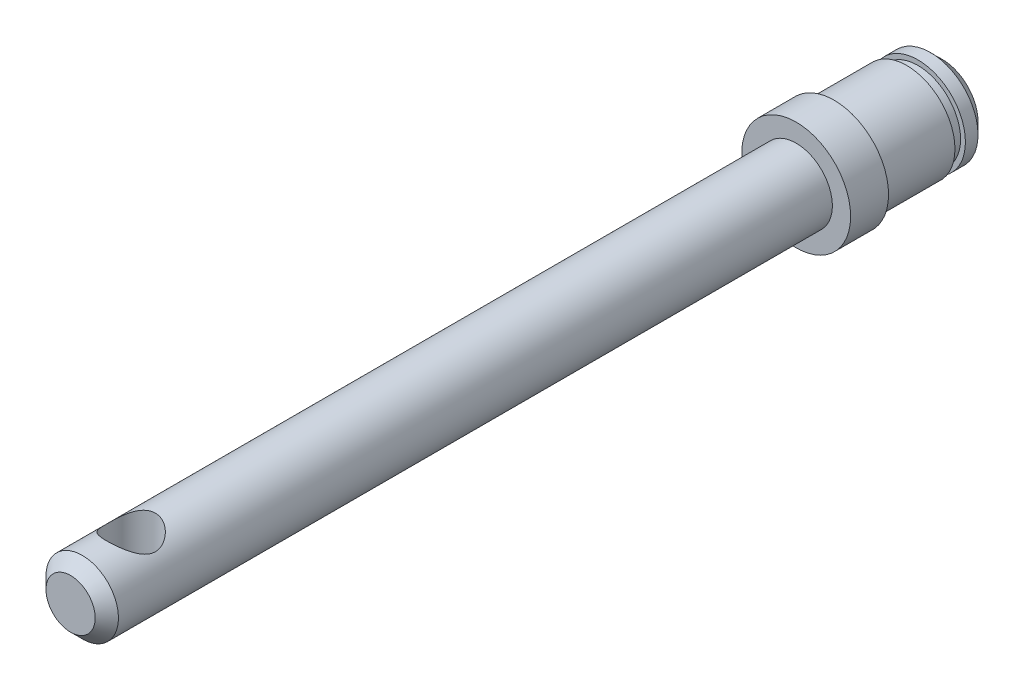
ISO-10303-21;
HEADER;
FILE_DESCRIPTION(('STEP AP214'),'2;1');
FILE_NAME('part.step','',(''),(''),'','','');
FILE_SCHEMA(('AUTOMOTIVE_DESIGN { 1 0 10303 214 1 1 1 1 }'));
ENDSEC;
DATA;
#1=APPLICATION_CONTEXT('core data for automotive mechanical design processes');
#2=APPLICATION_PROTOCOL_DEFINITION('international standard','automotive_design',2000,#1);
#3=PRODUCT_CONTEXT('',#1,'mechanical');
#4=PRODUCT('Part','Part','',(#3));
#5=PRODUCT_RELATED_PRODUCT_CATEGORY('part','',(#4));
#6=PRODUCT_DEFINITION_FORMATION('','',#4);
#7=PRODUCT_DEFINITION_CONTEXT('part definition',#1,'design');
#8=PRODUCT_DEFINITION('design','',#6,#7);
#9=PRODUCT_DEFINITION_SHAPE('','',#8);
#10=(LENGTH_UNIT() NAMED_UNIT(*) SI_UNIT(.MILLI.,.METRE.));
#11=(NAMED_UNIT(*) PLANE_ANGLE_UNIT() SI_UNIT($,.RADIAN.));
#12=(NAMED_UNIT(*) SI_UNIT($,.STERADIAN.) SOLID_ANGLE_UNIT());
#13=UNCERTAINTY_MEASURE_WITH_UNIT(LENGTH_MEASURE(1.E-05),#10,'distance_accuracy_value','');
#14=(GEOMETRIC_REPRESENTATION_CONTEXT(3) GLOBAL_UNCERTAINTY_ASSIGNED_CONTEXT((#13)) GLOBAL_UNIT_ASSIGNED_CONTEXT((#10,
#11,#12)) REPRESENTATION_CONTEXT('',''));
#15=CARTESIAN_POINT('',(0.,0.,0.));
#16=DIRECTION('',(0.,0.,1.));
#17=DIRECTION('',(1.,0.,0.));
#18=AXIS2_PLACEMENT_3D('',#15,#16,#17);
#19=CARTESIAN_POINT('',(0.,0.,-9.5758));
#20=DIRECTION('',(0.,0.,-1.));
#21=DIRECTION('',(-1.,0.,0.));
#22=AXIS2_PLACEMENT_3D('',#19,#20,#21);
#23=PLANE('',#22);
#24=CARTESIAN_POINT('',(0.,0.,-9.57579999993641));
#25=DIRECTION('',(0.,0.,1.));
#26=DIRECTION('',(1.,0.,0.));
#27=AXIS2_PLACEMENT_3D('',#24,#25,#26);
#28=CIRCLE('',#27,2.3494999999798);
#29=CARTESIAN_POINT('',(2.3494999999798,0.,-9.57579999993641));
#30=VERTEX_POINT('',#29);
#31=EDGE_CURVE('E18',#30,#30,#28,.T.);
#32=ORIENTED_EDGE('',*,*,#31,.F.);
#33=EDGE_LOOP('',(#32));
#34=FACE_BOUND('',#33,.T.);
#35=ADVANCED_FACE('F15',(#34),#23,.T.);
#36=CARTESIAN_POINT('',(0.,0.,-8.81380000009813));
#37=DIRECTION('',(0.,0.,1.));
#38=DIRECTION('',(1.,0.,0.));
#39=AXIS2_PLACEMENT_3D('',#36,#37,#38);
#40=CONICAL_SURFACE('',#39,3.11149999987492,0.785398163434747);
#41=ORIENTED_EDGE('',*,*,#31,.T.);
#42=EDGE_LOOP('',(#41));
#43=FACE_BOUND('',#42,.T.);
#44=CARTESIAN_POINT('',(0.,0.,-8.8138));
#45=DIRECTION('',(0.,0.,1.));
#46=DIRECTION('',(1.,0.,0.));
#47=AXIS2_PLACEMENT_3D('',#44,#45,#46);
#48=CIRCLE('',#47,3.1115);
#49=CARTESIAN_POINT('',(3.1115,0.,-8.8138));
#50=VERTEX_POINT('',#49);
#51=EDGE_CURVE('E34',#50,#50,#48,.T.);
#52=ORIENTED_EDGE('',*,*,#51,.F.);
#53=EDGE_LOOP('',(#52));
#54=FACE_BOUND('',#53,.T.);
#55=ADVANCED_FACE('F80',(#43,#54),#40,.T.);
#56=CARTESIAN_POINT('',(0.,0.,-9.5758));
#57=DIRECTION('',(0.,0.,1.));
#58=DIRECTION('',(1.,0.,0.));
#59=AXIS2_PLACEMENT_3D('',#56,#57,#58);
#60=CYLINDRICAL_SURFACE('',#59,3.1115);
#61=ORIENTED_EDGE('',*,*,#51,.T.);
#62=EDGE_LOOP('',(#61));
#63=FACE_BOUND('',#62,.T.);
#64=CARTESIAN_POINT('',(0.,0.,-7.9883));
#65=DIRECTION('',(0.,0.,1.));
#66=DIRECTION('',(1.,0.,0.));
#67=AXIS2_PLACEMENT_3D('',#64,#65,#66);
#68=CIRCLE('',#67,3.1115);
#69=CARTESIAN_POINT('',(3.1115,0.,-7.9883));
#70=VERTEX_POINT('',#69);
#71=EDGE_CURVE('E70',#70,#70,#68,.F.);
#72=ORIENTED_EDGE('',*,*,#71,.T.);
#73=EDGE_LOOP('',(#72));
#74=FACE_BOUND('',#73,.T.);
#75=ADVANCED_FACE('F88',(#63,#74),#60,.T.);
#76=CARTESIAN_POINT('',(0.,0.,-7.9883));
#77=DIRECTION('',(0.,0.,-1.));
#78=DIRECTION('',(-1.,0.,0.));
#79=AXIS2_PLACEMENT_3D('',#76,#77,#78);
#80=PLANE('',#79);
#81=CARTESIAN_POINT('',(0.,0.,-7.9883));
#82=DIRECTION('',(0.,0.,1.));
#83=DIRECTION('',(1.,0.,0.));
#84=AXIS2_PLACEMENT_3D('',#81,#82,#83);
#85=CIRCLE('',#84,2.794);
#86=CARTESIAN_POINT('',(2.794,0.,-7.9883));
#87=VERTEX_POINT('',#86);
#88=EDGE_CURVE('E68',#87,#87,#85,.T.);
#89=ORIENTED_EDGE('',*,*,#88,.F.);
#90=EDGE_LOOP('',(#89));
#91=FACE_BOUND('',#90,.T.);
#92=ORIENTED_EDGE('',*,*,#71,.F.);
#93=EDGE_LOOP('',(#92));
#94=FACE_BOUND('',#93,.T.);
#95=ADVANCED_FACE('F92',(#91,#94),#80,.F.);
#96=CARTESIAN_POINT('',(0.,0.,-7.9883));
#97=DIRECTION('',(0.,0.,1.));
#98=DIRECTION('',(1.,0.,0.));
#99=AXIS2_PLACEMENT_3D('',#96,#97,#98);
#100=CYLINDRICAL_SURFACE('',#99,2.794);
#101=CARTESIAN_POINT('',(0.,0.,-7.2517));
#102=DIRECTION('',(0.,0.,1.));
#103=DIRECTION('',(1.,0.,0.));
#104=AXIS2_PLACEMENT_3D('',#101,#102,#103);
#105=CIRCLE('',#104,2.794);
#106=CARTESIAN_POINT('',(2.794,0.,-7.2517));
#107=VERTEX_POINT('',#106);
#108=EDGE_CURVE('E65',#107,#107,#105,.T.);
#109=ORIENTED_EDGE('',*,*,#108,.F.);
#110=EDGE_LOOP('',(#109));
#111=FACE_BOUND('',#110,.T.);
#112=ORIENTED_EDGE('',*,*,#88,.T.);
#113=EDGE_LOOP('',(#112));
#114=FACE_BOUND('',#113,.T.);
#115=ADVANCED_FACE('F97',(#111,#114),#100,.T.);
#116=CARTESIAN_POINT('',(0.,0.,-7.2517));
#117=DIRECTION('',(0.,0.,-1.));
#118=DIRECTION('',(-1.,0.,0.));
#119=AXIS2_PLACEMENT_3D('',#116,#117,#118);
#120=PLANE('',#119);
#121=ORIENTED_EDGE('',*,*,#108,.T.);
#122=EDGE_LOOP('',(#121));
#123=FACE_BOUND('',#122,.T.);
#124=CARTESIAN_POINT('',(0.,0.,-7.2517));
#125=DIRECTION('',(0.,0.,1.));
#126=DIRECTION('',(1.,0.,0.));
#127=AXIS2_PLACEMENT_3D('',#124,#125,#126);
#128=CIRCLE('',#127,3.1623);
#129=CARTESIAN_POINT('',(3.1623,0.,-7.2517));
#130=VERTEX_POINT('',#129);
#131=EDGE_CURVE('E62',#130,#130,#128,.T.);
#132=ORIENTED_EDGE('',*,*,#131,.F.);
#133=EDGE_LOOP('',(#132));
#134=FACE_BOUND('',#133,.T.);
#135=ADVANCED_FACE('F101',(#123,#134),#120,.T.);
#136=CARTESIAN_POINT('',(0.,0.,-7.2517));
#137=DIRECTION('',(0.,0.,1.));
#138=DIRECTION('',(1.,0.,0.));
#139=AXIS2_PLACEMENT_3D('',#136,#137,#138);
#140=CYLINDRICAL_SURFACE('',#139,3.1623);
#141=ORIENTED_EDGE('',*,*,#131,.T.);
#142=EDGE_LOOP('',(#141));
#143=FACE_BOUND('',#142,.T.);
#144=CARTESIAN_POINT('',(0.,0.,-2.4892));
#145=DIRECTION('',(0.,0.,1.));
#146=DIRECTION('',(1.,0.,0.));
#147=AXIS2_PLACEMENT_3D('',#144,#145,#146);
#148=CIRCLE('',#147,3.1623);
#149=CARTESIAN_POINT('',(3.1623,0.,-2.4892));
#150=VERTEX_POINT('',#149);
#151=EDGE_CURVE('E59',#150,#150,#148,.F.);
#152=ORIENTED_EDGE('',*,*,#151,.T.);
#153=EDGE_LOOP('',(#152));
#154=FACE_BOUND('',#153,.T.);
#155=ADVANCED_FACE('F105',(#143,#154),#140,.T.);
#156=CARTESIAN_POINT('',(0.,0.,-2.4892));
#157=DIRECTION('',(0.,0.,1.));
#158=DIRECTION('',(1.,0.,0.));
#159=AXIS2_PLACEMENT_3D('',#156,#157,#158);
#160=PLANE('',#159);
#161=ORIENTED_EDGE('',*,*,#151,.F.);
#162=EDGE_LOOP('',(#161));
#163=FACE_BOUND('',#162,.T.);
#164=CARTESIAN_POINT('',(0.,0.,-2.4892));
#165=DIRECTION('',(0.,0.,1.));
#166=DIRECTION('',(1.,0.,0.));
#167=AXIS2_PLACEMENT_3D('',#164,#165,#166);
#168=CIRCLE('',#167,3.571875);
#169=CARTESIAN_POINT('',(3.571875,0.,-2.4892));
#170=VERTEX_POINT('',#169);
#171=EDGE_CURVE('E56',#170,#170,#168,.T.);
#172=ORIENTED_EDGE('',*,*,#171,.F.);
#173=EDGE_LOOP('',(#172));
#174=FACE_BOUND('',#173,.T.);
#175=ADVANCED_FACE('F109',(#163,#174),#160,.F.);
#176=CARTESIAN_POINT('',(0.,0.,47.5742));
#177=DIRECTION('',(0.,0.,1.));
#178=DIRECTION('',(1.,0.,0.));
#179=AXIS2_PLACEMENT_3D('',#176,#177,#178);
#180=PLANE('',#179);
#181=CARTESIAN_POINT('',(0.,0.,47.5741999999855));
#182=DIRECTION('',(0.,0.,-1.));
#183=DIRECTION('',(-1.,0.,0.));
#184=AXIS2_PLACEMENT_3D('',#181,#182,#183);
#185=CIRCLE('',#184,1.61289999999781);
#186=CARTESIAN_POINT('',(-1.61289999999781,0.,47.5741999999855));
#187=VERTEX_POINT('',#186);
#188=EDGE_CURVE('E53',#187,#187,#185,.T.);
#189=ORIENTED_EDGE('',*,*,#188,.F.);
#190=EDGE_LOOP('',(#189));
#191=FACE_BOUND('',#190,.T.);
#192=ADVANCED_FACE('F113',(#191),#180,.T.);
#193=CARTESIAN_POINT('',(0.,0.,-2.4892));
#194=DIRECTION('',(0.,0.,1.));
#195=DIRECTION('',(1.,0.,0.));
#196=AXIS2_PLACEMENT_3D('',#193,#194,#195);
#197=CYLINDRICAL_SURFACE('',#196,3.571875);
#198=ORIENTED_EDGE('',*,*,#171,.T.);
#199=EDGE_LOOP('',(#198));
#200=FACE_BOUND('',#199,.T.);
#201=CARTESIAN_POINT('',(0.,0.,0.));
#202=DIRECTION('',(0.,0.,1.));
#203=DIRECTION('',(1.,0.,0.));
#204=AXIS2_PLACEMENT_3D('',#201,#202,#203);
#205=CIRCLE('',#204,3.571875);
#206=CARTESIAN_POINT('',(3.571875,0.,0.));
#207=VERTEX_POINT('',#206);
#208=EDGE_CURVE('E50',#207,#207,#205,.T.);
#209=ORIENTED_EDGE('',*,*,#208,.F.);
#210=EDGE_LOOP('',(#209));
#211=FACE_BOUND('',#210,.T.);
#212=ADVANCED_FACE('F117',(#200,#211),#197,.T.);
#213=CARTESIAN_POINT('',(0.,0.,46.8121999999767));
#214=DIRECTION('',(0.,0.,-1.));
#215=DIRECTION('',(-1.,0.,0.));
#216=AXIS2_PLACEMENT_3D('',#213,#214,#215);
#217=CONICAL_SURFACE('',#216,2.37490000000662,0.785398163397448);
#218=ORIENTED_EDGE('',*,*,#188,.T.);
#219=EDGE_LOOP('',(#218));
#220=FACE_BOUND('',#219,.T.);
#221=CARTESIAN_POINT('',(0.,0.,46.8122));
#222=DIRECTION('',(0.,0.,-1.));
#223=DIRECTION('',(-1.,0.,0.));
#224=AXIS2_PLACEMENT_3D('',#221,#222,#223);
#225=CIRCLE('',#224,2.3749);
#226=CARTESIAN_POINT('',(-2.3749,0.,46.8122));
#227=VERTEX_POINT('',#226);
#228=EDGE_CURVE('E27',#227,#227,#225,.T.);
#229=ORIENTED_EDGE('',*,*,#228,.F.);
#230=EDGE_LOOP('',(#229));
#231=FACE_BOUND('',#230,.T.);
#232=ADVANCED_FACE('F121',(#220,#231),#217,.T.);
#233=CARTESIAN_POINT('',(0.,0.,0.));
#234=DIRECTION('',(0.,0.,1.));
#235=DIRECTION('',(1.,0.,0.));
#236=AXIS2_PLACEMENT_3D('',#233,#234,#235);
#237=PLANE('',#236);
#238=CARTESIAN_POINT('',(0.,0.,0.));
#239=DIRECTION('',(0.,0.,-1.));
#240=DIRECTION('',(-1.,0.,0.));
#241=AXIS2_PLACEMENT_3D('',#238,#239,#240);
#242=CIRCLE('',#241,2.3749);
#243=CARTESIAN_POINT('',(-2.3749,0.,0.));
#244=VERTEX_POINT('',#243);
#245=EDGE_CURVE('E22',#244,#244,#242,.F.);
#246=ORIENTED_EDGE('',*,*,#245,.F.);
#247=EDGE_LOOP('',(#246));
#248=FACE_BOUND('',#247,.T.);
#249=ORIENTED_EDGE('',*,*,#208,.T.);
#250=EDGE_LOOP('',(#249));
#251=FACE_BOUND('',#250,.T.);
#252=ADVANCED_FACE('F124',(#248,#251),#237,.T.);
#253=CARTESIAN_POINT('',(0.,-3.571875,43.60545));
#254=DIRECTION('',(0.,1.,0.));
#255=DIRECTION('',(0.,0.,1.));
#256=AXIS2_PLACEMENT_3D('',#253,#254,#255);
#257=CYLINDRICAL_SURFACE('',#256,1.5875);
#258=CARTESIAN_POINT('',(0.,2.3749,45.19295));
#259=CARTESIAN_POINT('',(-0.0796285021727966,2.37489427166207,45.1929439134093));
#260=CARTESIAN_POINT('',(-0.159333187346092,2.3708547437601,45.1869178453679));
#261=CARTESIAN_POINT('',(-0.316246788253907,2.35507625489168,45.1631617849446));
#262=CARTESIAN_POINT('',(-0.393451638249593,2.34332535323937,45.1454136412255));
#263=CARTESIAN_POINT('',(-0.542790518515763,2.31328830758023,45.0993083312295));
#264=CARTESIAN_POINT('',(-0.614948378456795,2.29503576257873,45.0710056736267));
#265=CARTESIAN_POINT('',(-0.753178545236462,2.25346165524091,45.0050040485006));
#266=CARTESIAN_POINT('',(-0.819251194999285,2.23014037879558,44.9673056109087));
#267=CARTESIAN_POINT('',(-0.949807131451189,2.17792784028168,44.8800881288627));
#268=CARTESIAN_POINT('',(-1.01367601133952,2.14873138397025,44.8298358883516));
#269=CARTESIAN_POINT('',(-1.13266066753279,2.0884656766868,44.7206931180195));
#270=CARTESIAN_POINT('',(-1.18776336726205,2.05739372150985,44.6617899306125));
#271=CARTESIAN_POINT('',(-1.29659427145063,1.99089626995362,44.5261680967343));
#272=CARTESIAN_POINT('',(-1.34871636553572,1.95556248733199,44.4481056626616));
#273=CARTESIAN_POINT('',(-1.43904349853149,1.89008374794265,44.2823403381314));
#274=CARTESIAN_POINT('',(-1.4772725865024,1.85992987284409,44.1946544520516));
#275=CARTESIAN_POINT('',(-1.52904517834333,1.81740283377534,44.0377472795276));
#276=CARTESIAN_POINT('',(-1.54653236351236,1.80240921282223,43.9705447171603));
#277=CARTESIAN_POINT('',(-1.57261168441343,1.77970474695812,43.8332848433952));
#278=CARTESIAN_POINT('',(-1.58121930044462,1.7719812296935,43.763232722255));
#279=CARTESIAN_POINT('',(-1.58899802612375,1.76501215254764,43.6218716388384));
#280=CARTESIAN_POINT('',(-1.58812985724121,1.76580188116326,43.5505586693621));
#281=CARTESIAN_POINT('',(-1.57692650593038,1.77581049841768,43.4092572197684));
#282=CARTESIAN_POINT('',(-1.56658327442516,1.7850365537139,43.3392699174096));
#283=CARTESIAN_POINT('',(-1.53778680769931,1.80988877384798,43.2056567626746));
#284=CARTESIAN_POINT('',(-1.51972103829905,1.82520699487101,43.1418863605764));
#285=CARTESIAN_POINT('',(-1.47635800673587,1.86045582345457,43.0182351850859));
#286=CARTESIAN_POINT('',(-1.45105836975688,1.88038794530891,42.9583556969829));
#287=CARTESIAN_POINT('',(-1.38804369169894,1.92751840139636,42.8311724358925));
#288=CARTESIAN_POINT('',(-1.34884877883874,1.95536954816995,42.7648460457442));
#289=CARTESIAN_POINT('',(-1.26169992826936,2.01270750683002,42.6389401049234));
#290=CARTESIAN_POINT('',(-1.21373539144903,2.04219626760565,42.5793688613398));
#291=CARTESIAN_POINT('',(-1.09822042057742,2.10697571698643,42.4553504562286));
#292=CARTESIAN_POINT('',(-1.02867941502371,2.14213147691545,42.3926663982129));
#293=CARTESIAN_POINT('',(-0.87829590652397,2.20804612806214,42.2797162875604));
#294=CARTESIAN_POINT('',(-0.797461070213304,2.23880797360637,42.2294418743602));
#295=CARTESIAN_POINT('',(-0.642794196366182,2.28740091649053,42.151857840345));
#296=CARTESIAN_POINT('',(-0.570673934887535,2.30658392602361,42.1219812810788));
#297=CARTESIAN_POINT('',(-0.421590346714549,2.33841465201831,42.0729550712348));
#298=CARTESIAN_POINT('',(-0.344638477425361,2.35107721947041,42.05378103609));
#299=CARTESIAN_POINT('',(-0.222529004084351,2.36486476954346,42.0329936390966));
#300=CARTESIAN_POINT('',(-0.178308116016056,2.36861511899109,42.0273651451537));
#301=CARTESIAN_POINT('',(-0.0893995612791168,2.37363462559172,42.0198411908061));
#302=CARTESIAN_POINT('',(-0.0447117904210668,2.37490321648955,42.0179465823498));
#303=CARTESIAN_POINT('',(0.0796285021727959,2.37489427166207,42.0179560865907));
#304=CARTESIAN_POINT('',(0.159333187346092,2.3708547437601,42.0239821546321));
#305=CARTESIAN_POINT('',(0.316246788253906,2.35507625489168,42.0477382150553));
#306=CARTESIAN_POINT('',(0.393451638249593,2.34332535323937,42.0654863587745));
#307=CARTESIAN_POINT('',(0.542790518515763,2.31328830758023,42.1115916687705));
#308=CARTESIAN_POINT('',(0.614948378456795,2.29503576257873,42.1398943263733));
#309=CARTESIAN_POINT('',(0.753178545236463,2.25346165524091,42.2058959514994));
#310=CARTESIAN_POINT('',(0.819251194999285,2.23014037879558,42.2435943890913));
#311=CARTESIAN_POINT('',(0.949807131451189,2.17792784028168,42.3308118711373));
#312=CARTESIAN_POINT('',(1.01367601133952,2.14873138397025,42.3810641116484));
#313=CARTESIAN_POINT('',(1.13266066753279,2.0884656766868,42.4902068819805));
#314=CARTESIAN_POINT('',(1.18776336726205,2.05739372150985,42.5491100693874));
#315=CARTESIAN_POINT('',(1.29659427145063,1.99089626995362,42.6847319032657));
#316=CARTESIAN_POINT('',(1.34871636553572,1.95556248733199,42.7627943373384));
#317=CARTESIAN_POINT('',(1.43904349853149,1.89008374794265,42.9285596618686));
#318=CARTESIAN_POINT('',(1.4772725865024,1.85992987284409,43.0162455479484));
#319=CARTESIAN_POINT('',(1.52904517834333,1.81740283377534,43.1731527204724));
#320=CARTESIAN_POINT('',(1.54653236351236,1.80240921282223,43.2403552828397));
#321=CARTESIAN_POINT('',(1.57261168441343,1.77970474695812,43.3776151566048));
#322=CARTESIAN_POINT('',(1.58121930044462,1.7719812296935,43.447667277745));
#323=CARTESIAN_POINT('',(1.58899802612375,1.76501215254764,43.5890283611616));
#324=CARTESIAN_POINT('',(1.58812985724121,1.76580188116326,43.6603413306379));
#325=CARTESIAN_POINT('',(1.57692650593038,1.77581049841768,43.8016427802316));
#326=CARTESIAN_POINT('',(1.56658327442517,1.7850365537139,43.8716300825904));
#327=CARTESIAN_POINT('',(1.53778680769931,1.80988877384798,44.0052432373254));
#328=CARTESIAN_POINT('',(1.51972103829905,1.825206994871,44.0690136394236));
#329=CARTESIAN_POINT('',(1.47635800673587,1.86045582345457,44.192664814914));
#330=CARTESIAN_POINT('',(1.45105836975689,1.88038794530891,44.2525443030171));
#331=CARTESIAN_POINT('',(1.38804369169894,1.92751840139636,44.3797275641075));
#332=CARTESIAN_POINT('',(1.34884877883874,1.95536954816995,44.4460539542558));
#333=CARTESIAN_POINT('',(1.26169992826936,2.01270750683002,44.5719598950766));
#334=CARTESIAN_POINT('',(1.21373539144903,2.04219626760564,44.6315311386602));
#335=CARTESIAN_POINT('',(1.09822042057742,2.10697571698643,44.7555495437714));
#336=CARTESIAN_POINT('',(1.02867941502371,2.14213147691544,44.8182336017871));
#337=CARTESIAN_POINT('',(0.87829590652398,2.20804612806214,44.9311837124396));
#338=CARTESIAN_POINT('',(0.797461070213316,2.23880797360636,44.9814581256398));
#339=CARTESIAN_POINT('',(0.642794196366197,2.28740091649053,45.059042159655));
#340=CARTESIAN_POINT('',(0.57067393488755,2.30658392602361,45.0889187189212));
#341=CARTESIAN_POINT('',(0.421590346714565,2.33841465201831,45.1379449287651));
#342=CARTESIAN_POINT('',(0.344638477425378,2.3510772194704,45.15711896391));
#343=CARTESIAN_POINT('',(0.222529004084365,2.36486476954346,45.1779063609034));
#344=CARTESIAN_POINT('',(0.178308116016067,2.36861511899109,45.1835348548463));
#345=CARTESIAN_POINT('',(0.0893995612791212,2.37363462559172,45.1910588091939));
#346=CARTESIAN_POINT('',(0.0447117904210687,2.37490321648955,45.1929534176502));
#347=CARTESIAN_POINT('',(0.,2.3749,45.19295));
#348=B_SPLINE_CURVE_WITH_KNOTS('',3,(#258,#259,#260,#261,#262,#263,#264,#265,#266,#267,#268,
#269,#270,#271,#272,#273,#274,#275,#276,#277,#278,#279,#280,#281,#282,#283,#284,#285,#286,#287,
#288,#289,#290,#291,#292,#293,#294,#295,#296,#297,#298,#299,#300,#301,#302,#303,#304,#305,#306,
#307,#308,#309,#310,#311,#312,#313,#314,#315,#316,#317,#318,#319,#320,#321,#322,#323,#324,#325,
#326,#327,#328,#329,#330,#331,#332,#333,#334,#335,#336,#337,#338,#339,#340,#341,#342,#343,#344,
#345,#346,#347),.UNSPECIFIED.,.T.,.F.,(4,2,2,2,2,2,2,2,2,2,2,2,2,2,2,2,2,2,2,2,2,2,2,2,2,2,2,2,
2,2,2,2,2,2,2,2,2,2,2,2,2,2,2,2,4),(0.,0.238700395852421,0.477771282535445,0.71562421428543,
0.95346373392742,1.21155549797826,1.47002872073382,1.76952408912618,2.06849852769238,
2.28077891750231,2.49268859719911,2.70547700634111,2.9184463472867,3.12179507761272,
3.32521064236503,3.57012288877609,3.815333120713,4.1139409115089,4.41234697329097,
4.65252034508975,4.89214425005817,5.02614510978654,5.16017654051243,5.39887693636485,
5.63794782304788,5.87580075479786,6.11364027443985,6.37173203849069,6.63020526124625,
6.92970062963861,7.22867506820481,7.44095545801474,7.65286513771153,7.86565354685354,
8.07862288779913,8.28197161812515,8.48538718287745,8.73029942928851,8.97550966122542,
9.27411745202132,9.57252351380338,9.81269688560216,10.0523207905706,10.186321650299,
10.3203530810249),.UNSPECIFIED.);
#349=CARTESIAN_POINT('',(0.,2.3749,45.19295));
#350=VERTEX_POINT('',#349);
#351=EDGE_CURVE('E45',#350,#350,#348,.T.);
#352=ORIENTED_EDGE('',*,*,#351,.F.);
#353=EDGE_LOOP('',(#352));
#354=FACE_BOUND('',#353,.T.);
#355=CARTESIAN_POINT('',(0.,-2.3749,45.19295));
#356=CARTESIAN_POINT('',(0.079628502172797,-2.37489427166208,45.1929439134093));
#357=CARTESIAN_POINT('',(0.159333187346093,-2.3708547437601,45.1869178453679));
#358=CARTESIAN_POINT('',(0.316246788253907,-2.35507625489168,45.1631617849446));
#359=CARTESIAN_POINT('',(0.393451638249594,-2.34332535323937,45.1454136412255));
#360=CARTESIAN_POINT('',(0.542790518515763,-2.31328830758023,45.0993083312295));
#361=CARTESIAN_POINT('',(0.614948378456796,-2.29503576257873,45.0710056736267));
#362=CARTESIAN_POINT('',(0.753178545236462,-2.25346165524091,45.0050040485006));
#363=CARTESIAN_POINT('',(0.819251194999285,-2.23014037879558,44.9673056109087));
#364=CARTESIAN_POINT('',(0.949807131451189,-2.17792784028168,44.8800881288627));
#365=CARTESIAN_POINT('',(1.01367601133952,-2.14873138397025,44.8298358883516));
#366=CARTESIAN_POINT('',(1.13266066753279,-2.0884656766868,44.7206931180195));
#367=CARTESIAN_POINT('',(1.18776336726205,-2.05739372150985,44.6617899306125));
#368=CARTESIAN_POINT('',(1.29659427145063,-1.99089626995362,44.5261680967343));
#369=CARTESIAN_POINT('',(1.34871636553572,-1.95556248733199,44.4481056626616));
#370=CARTESIAN_POINT('',(1.43904349853149,-1.89008374794265,44.2823403381314));
#371=CARTESIAN_POINT('',(1.4772725865024,-1.85992987284409,44.1946544520516));
#372=CARTESIAN_POINT('',(1.52904517834333,-1.81740283377534,44.0377472795276));
#373=CARTESIAN_POINT('',(1.54653236351237,-1.80240921282223,43.9705447171602));
#374=CARTESIAN_POINT('',(1.57261168441344,-1.77970474695812,43.8332848433952));
#375=CARTESIAN_POINT('',(1.58121930044462,-1.7719812296935,43.763232722255));
#376=CARTESIAN_POINT('',(1.58899802612375,-1.76501215254764,43.6218716388384));
#377=CARTESIAN_POINT('',(1.58812985724121,-1.76580188116326,43.5505586693621));
#378=CARTESIAN_POINT('',(1.57692650593038,-1.77581049841768,43.4092572197684));
#379=CARTESIAN_POINT('',(1.56658327442516,-1.7850365537139,43.3392699174096));
#380=CARTESIAN_POINT('',(1.53778680769931,-1.80988877384798,43.2056567626746));
#381=CARTESIAN_POINT('',(1.51972103829905,-1.82520699487101,43.1418863605764));
#382=CARTESIAN_POINT('',(1.47635800673587,-1.86045582345457,43.0182351850859));
#383=CARTESIAN_POINT('',(1.45105836975688,-1.88038794530891,42.9583556969829));
#384=CARTESIAN_POINT('',(1.38804369169894,-1.92751840139636,42.8311724358925));
#385=CARTESIAN_POINT('',(1.34884877883874,-1.95536954816995,42.7648460457442));
#386=CARTESIAN_POINT('',(1.26169992826936,-2.01270750683002,42.6389401049234));
#387=CARTESIAN_POINT('',(1.21373539144903,-2.04219626760565,42.5793688613398));
#388=CARTESIAN_POINT('',(1.09822042057742,-2.10697571698643,42.4553504562286));
#389=CARTESIAN_POINT('',(1.0286794150237,-2.14213147691545,42.3926663982129));
#390=CARTESIAN_POINT('',(0.878295906523966,-2.20804612806214,42.2797162875604));
#391=CARTESIAN_POINT('',(0.797461070213302,-2.23880797360637,42.2294418743602));
#392=CARTESIAN_POINT('',(0.642794196366183,-2.28740091649053,42.151857840345));
#393=CARTESIAN_POINT('',(0.570673934887537,-2.30658392602361,42.1219812810788));
#394=CARTESIAN_POINT('',(0.421590346714551,-2.33841465201831,42.0729550712348));
#395=CARTESIAN_POINT('',(0.344638477425362,-2.35107721947041,42.05378103609));
#396=CARTESIAN_POINT('',(0.22252900408435,-2.36486476954346,42.0329936390966));
#397=CARTESIAN_POINT('',(0.178308116016056,-2.36861511899109,42.0273651451537));
#398=CARTESIAN_POINT('',(0.0893995612791169,-2.37363462559172,42.0198411908061));
#399=CARTESIAN_POINT('',(0.0447117904210671,-2.37490321648955,42.0179465823498));
#400=CARTESIAN_POINT('',(-0.0796285021727957,-2.37489427166208,42.0179560865907));
#401=CARTESIAN_POINT('',(-0.159333187346092,-2.3708547437601,42.0239821546321));
#402=CARTESIAN_POINT('',(-0.316246788253906,-2.35507625489168,42.0477382150553));
#403=CARTESIAN_POINT('',(-0.393451638249593,-2.34332535323937,42.0654863587745));
#404=CARTESIAN_POINT('',(-0.542790518515762,-2.31328830758023,42.1115916687705));
#405=CARTESIAN_POINT('',(-0.614948378456795,-2.29503576257873,42.1398943263733));
#406=CARTESIAN_POINT('',(-0.753178545236462,-2.25346165524091,42.2058959514994));
#407=CARTESIAN_POINT('',(-0.819251194999284,-2.23014037879558,42.2435943890913));
#408=CARTESIAN_POINT('',(-0.949807131451189,-2.17792784028168,42.3308118711373));
#409=CARTESIAN_POINT('',(-1.01367601133952,-2.14873138397025,42.3810641116484));
#410=CARTESIAN_POINT('',(-1.13266066753279,-2.0884656766868,42.4902068819805));
#411=CARTESIAN_POINT('',(-1.18776336726205,-2.05739372150985,42.5491100693874));
#412=CARTESIAN_POINT('',(-1.29659427145063,-1.99089626995362,42.6847319032657));
#413=CARTESIAN_POINT('',(-1.34871636553572,-1.95556248733199,42.7627943373384));
#414=CARTESIAN_POINT('',(-1.43904349853149,-1.89008374794265,42.9285596618686));
#415=CARTESIAN_POINT('',(-1.4772725865024,-1.85992987284409,43.0162455479484));
#416=CARTESIAN_POINT('',(-1.52904517834333,-1.81740283377534,43.1731527204724));
#417=CARTESIAN_POINT('',(-1.54653236351237,-1.80240921282223,43.2403552828398));
#418=CARTESIAN_POINT('',(-1.57261168441344,-1.77970474695812,43.3776151566048));
#419=CARTESIAN_POINT('',(-1.58121930044462,-1.7719812296935,43.447667277745));
#420=CARTESIAN_POINT('',(-1.58899802612375,-1.76501215254764,43.5890283611616));
#421=CARTESIAN_POINT('',(-1.58812985724121,-1.76580188116326,43.6603413306379));
#422=CARTESIAN_POINT('',(-1.57692650593038,-1.77581049841768,43.8016427802316));
#423=CARTESIAN_POINT('',(-1.56658327442516,-1.7850365537139,43.8716300825904));
#424=CARTESIAN_POINT('',(-1.53778680769931,-1.80988877384798,44.0052432373254));
#425=CARTESIAN_POINT('',(-1.51972103829905,-1.82520699487101,44.0690136394236));
#426=CARTESIAN_POINT('',(-1.47635800673587,-1.86045582345457,44.192664814914));
#427=CARTESIAN_POINT('',(-1.45105836975688,-1.88038794530891,44.2525443030171));
#428=CARTESIAN_POINT('',(-1.38804369169894,-1.92751840139636,44.3797275641075));
#429=CARTESIAN_POINT('',(-1.34884877883874,-1.95536954816995,44.4460539542558));
#430=CARTESIAN_POINT('',(-1.26169992826936,-2.01270750683002,44.5719598950766));
#431=CARTESIAN_POINT('',(-1.21373539144903,-2.04219626760565,44.6315311386602));
#432=CARTESIAN_POINT('',(-1.09822042057742,-2.10697571698643,44.7555495437714));
#433=CARTESIAN_POINT('',(-1.02867941502371,-2.14213147691544,44.8182336017871));
#434=CARTESIAN_POINT('',(-0.878295906523972,-2.20804612806214,44.9311837124396));
#435=CARTESIAN_POINT('',(-0.797461070213305,-2.23880797360637,44.9814581256398));
#436=CARTESIAN_POINT('',(-0.642794196366183,-2.28740091649053,45.059042159655));
#437=CARTESIAN_POINT('',(-0.570673934887537,-2.30658392602361,45.0889187189212));
#438=CARTESIAN_POINT('',(-0.421590346714551,-2.33841465201831,45.1379449287651));
#439=CARTESIAN_POINT('',(-0.344638477425362,-2.35107721947041,45.15711896391));
#440=CARTESIAN_POINT('',(-0.22252900408435,-2.36486476954346,45.1779063609034));
#441=CARTESIAN_POINT('',(-0.178308116016055,-2.36861511899109,45.1835348548463));
#442=CARTESIAN_POINT('',(-0.0893995612791154,-2.37363462559172,45.1910588091939));
#443=CARTESIAN_POINT('',(-0.0447117904210655,-2.37490321648955,45.1929534176502));
#444=CARTESIAN_POINT('',(0.,-2.3749,45.19295));
#445=B_SPLINE_CURVE_WITH_KNOTS('',3,(#355,#356,#357,#358,#359,#360,#361,#362,#363,#364,#365,
#366,#367,#368,#369,#370,#371,#372,#373,#374,#375,#376,#377,#378,#379,#380,#381,#382,#383,#384,
#385,#386,#387,#388,#389,#390,#391,#392,#393,#394,#395,#396,#397,#398,#399,#400,#401,#402,#403,
#404,#405,#406,#407,#408,#409,#410,#411,#412,#413,#414,#415,#416,#417,#418,#419,#420,#421,#422,
#423,#424,#425,#426,#427,#428,#429,#430,#431,#432,#433,#434,#435,#436,#437,#438,#439,#440,#441,
#442,#443,#444),.UNSPECIFIED.,.T.,.F.,(4,2,2,2,2,2,2,2,2,2,2,2,2,2,2,2,2,2,2,2,2,2,2,2,2,2,2,2,
2,2,2,2,2,2,2,2,2,2,2,2,2,2,2,2,4),(0.,0.238700395852421,0.477771282535445,0.71562421428543,
0.953463733927419,1.21155549797826,1.47002872073382,1.76952408912618,2.06849852769238,
2.28077891750232,2.49268859719911,2.70547700634111,2.9184463472867,3.12179507761272,
3.32521064236503,3.57012288877609,3.815333120713,4.11394091150891,4.41234697329097,
4.65252034508974,4.89214425005817,5.02614510978654,5.16017654051243,5.39887693636485,
5.63794782304788,5.87580075479786,6.11364027443985,6.37173203849069,6.63020526124625,
6.92970062963861,7.22867506820481,7.44095545801475,7.65286513771154,7.86565354685354,
8.07862288779913,8.28197161812515,8.48538718287746,8.73029942928852,8.97550966122543,
9.27411745202133,9.5725235138034,9.81269688560218,10.0523207905706,10.186321650299,
10.3203530810249),.UNSPECIFIED.);
#446=CARTESIAN_POINT('',(0.,-2.3749,45.19295));
#447=VERTEX_POINT('',#446);
#448=EDGE_CURVE('E10',#447,#447,#445,.T.);
#449=ORIENTED_EDGE('',*,*,#448,.F.);
#450=EDGE_LOOP('',(#449));
#451=FACE_BOUND('',#450,.T.);
#452=ADVANCED_FACE('F37',(#354,#451),#257,.F.);
#453=CARTESIAN_POINT('',(0.,0.,47.5742));
#454=DIRECTION('',(0.,0.,-1.));
#455=DIRECTION('',(-1.,0.,0.));
#456=AXIS2_PLACEMENT_3D('',#453,#454,#455);
#457=CYLINDRICAL_SURFACE('',#456,2.3749);
#458=ORIENTED_EDGE('',*,*,#228,.T.);
#459=EDGE_LOOP('',(#458));
#460=FACE_BOUND('',#459,.T.);
#461=ORIENTED_EDGE('',*,*,#448,.T.);
#462=EDGE_LOOP('',(#461));
#463=FACE_BOUND('',#462,.T.);
#464=ORIENTED_EDGE('',*,*,#245,.T.);
#465=EDGE_LOOP('',(#464));
#466=FACE_BOUND('',#465,.T.);
#467=ORIENTED_EDGE('',*,*,#351,.T.);
#468=EDGE_LOOP('',(#467));
#469=FACE_BOUND('',#468,.T.);
#470=ADVANCED_FACE('F40',(#460,#463,#466,#469),#457,.T.);
#471=CLOSED_SHELL('',(#35,#55,#75,#95,#115,#135,#155,#175,#192,#212,#232,#252,#452,#470));
#472=MANIFOLD_SOLID_BREP('B1',#471);
#473=ADVANCED_BREP_SHAPE_REPRESENTATION('',(#18,#472),#14);
#474=SHAPE_DEFINITION_REPRESENTATION(#9,#473);
ENDSEC;
END-ISO-10303-21;
